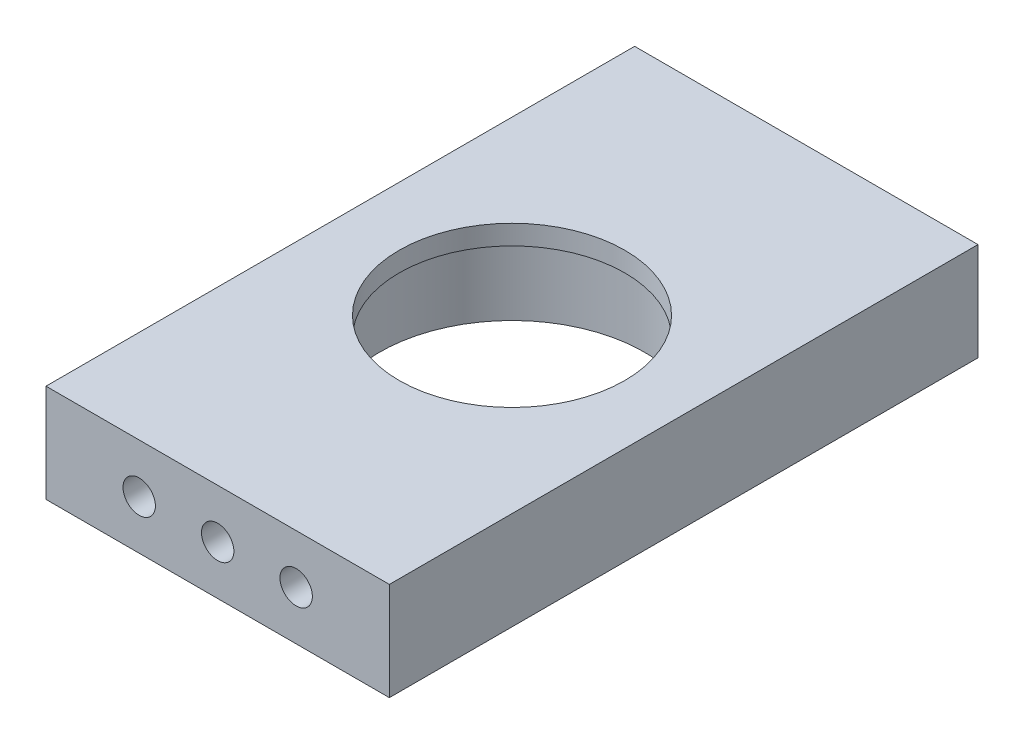
ISO-10303-21;
HEADER;
FILE_DESCRIPTION(('STEP AP214'),'2;1');
FILE_NAME('part.step','',(''),(''),'','','');
FILE_SCHEMA(('AUTOMOTIVE_DESIGN { 1 0 10303 214 1 1 1 1 }'));
ENDSEC;
DATA;
#1=APPLICATION_CONTEXT('core data for automotive mechanical design processes');
#2=APPLICATION_PROTOCOL_DEFINITION('international standard','automotive_design',2000,#1);
#3=PRODUCT_CONTEXT('',#1,'mechanical');
#4=PRODUCT('Part','Part','',(#3));
#5=PRODUCT_RELATED_PRODUCT_CATEGORY('part','',(#4));
#6=PRODUCT_DEFINITION_FORMATION('','',#4);
#7=PRODUCT_DEFINITION_CONTEXT('part definition',#1,'design');
#8=PRODUCT_DEFINITION('design','',#6,#7);
#9=PRODUCT_DEFINITION_SHAPE('','',#8);
#10=(LENGTH_UNIT() NAMED_UNIT(*) SI_UNIT(.MILLI.,.METRE.));
#11=(NAMED_UNIT(*) PLANE_ANGLE_UNIT() SI_UNIT($,.RADIAN.));
#12=(NAMED_UNIT(*) SI_UNIT($,.STERADIAN.) SOLID_ANGLE_UNIT());
#13=UNCERTAINTY_MEASURE_WITH_UNIT(LENGTH_MEASURE(1.E-05),#10,'distance_accuracy_value','');
#14=(GEOMETRIC_REPRESENTATION_CONTEXT(3) GLOBAL_UNCERTAINTY_ASSIGNED_CONTEXT((#13)) GLOBAL_UNIT_ASSIGNED_CONTEXT((#10,
#11,#12)) REPRESENTATION_CONTEXT('',''));
#15=CARTESIAN_POINT('',(0.,0.,0.));
#16=DIRECTION('',(0.,0.,1.));
#17=DIRECTION('',(1.,0.,0.));
#18=AXIS2_PLACEMENT_3D('',#15,#16,#17);
#19=CARTESIAN_POINT('',(0.,10.,0.));
#20=DIRECTION('',(0.,-1.,0.));
#21=DIRECTION('',(0.,0.,-1.));
#22=AXIS2_PLACEMENT_3D('',#19,#20,#21);
#23=CYLINDRICAL_SURFACE('',#22,13.5);
#24=CARTESIAN_POINT('',(0.,0.,0.));
#25=DIRECTION('',(0.,1.,0.));
#26=DIRECTION('',(0.,0.,1.));
#27=AXIS2_PLACEMENT_3D('',#24,#25,#26);
#28=CIRCLE('',#27,13.5);
#29=CARTESIAN_POINT('',(0.,0.,13.5));
#30=VERTEX_POINT('',#29);
#31=EDGE_CURVE('E158',#30,#30,#28,.T.);
#32=ORIENTED_EDGE('',*,*,#31,.F.);
#33=EDGE_LOOP('',(#32));
#34=FACE_BOUND('',#33,.T.);
#35=CARTESIAN_POINT('',(0.,8.,0.));
#36=DIRECTION('',(0.,1.,0.));
#37=DIRECTION('',(0.,0.,1.));
#38=AXIS2_PLACEMENT_3D('',#35,#36,#37);
#39=CIRCLE('',#38,13.5);
#40=CARTESIAN_POINT('',(0.,8.,13.5));
#41=VERTEX_POINT('',#40);
#42=EDGE_CURVE('E153',#41,#41,#39,.T.);
#43=ORIENTED_EDGE('',*,*,#42,.T.);
#44=EDGE_LOOP('',(#43));
#45=FACE_BOUND('',#44,.T.);
#46=ADVANCED_FACE('F37',(#34,#45),#23,.F.);
#47=CARTESIAN_POINT('',(0.,10.,0.));
#48=DIRECTION('',(0.,1.,0.));
#49=DIRECTION('',(0.,0.,1.));
#50=AXIS2_PLACEMENT_3D('',#47,#48,#49);
#51=PLANE('',#50);
#52=DIRECTION('',(0.,0.,-1.));
#53=VECTOR('',#52,1.);
#54=CARTESIAN_POINT('',(17.5,10.,-30.));
#55=LINE('',#54,#53);
#56=CARTESIAN_POINT('',(17.5,10.,30.));
#57=VERTEX_POINT('',#56);
#58=CARTESIAN_POINT('',(17.5,10.,-30.));
#59=VERTEX_POINT('',#58);
#60=EDGE_CURVE('E162',#57,#59,#55,.T.);
#61=ORIENTED_EDGE('',*,*,#60,.T.);
#62=DIRECTION('',(-1.,0.,0.));
#63=VECTOR('',#62,1.);
#64=CARTESIAN_POINT('',(-17.5,10.,-30.));
#65=LINE('',#64,#63);
#66=CARTESIAN_POINT('',(-17.5,10.,-30.));
#67=VERTEX_POINT('',#66);
#68=EDGE_CURVE('E85',#59,#67,#65,.T.);
#69=ORIENTED_EDGE('',*,*,#68,.T.);
#70=DIRECTION('',(0.,0.,1.));
#71=VECTOR('',#70,1.);
#72=CARTESIAN_POINT('',(-17.5,10.,-30.));
#73=LINE('',#72,#71);
#74=CARTESIAN_POINT('',(-17.5,10.,30.));
#75=VERTEX_POINT('',#74);
#76=EDGE_CURVE('E165',#67,#75,#73,.T.);
#77=ORIENTED_EDGE('',*,*,#76,.T.);
#78=DIRECTION('',(1.,0.,0.));
#79=VECTOR('',#78,1.);
#80=CARTESIAN_POINT('',(-17.5,10.,30.));
#81=LINE('',#80,#79);
#82=EDGE_CURVE('E54',#75,#57,#81,.T.);
#83=ORIENTED_EDGE('',*,*,#82,.T.);
#84=EDGE_LOOP('',(#61,#69,#77,#83));
#85=FACE_BOUND('',#84,.T.);
#86=CARTESIAN_POINT('',(0.,10.,0.));
#87=DIRECTION('',(0.,1.,0.));
#88=DIRECTION('',(0.,0.,1.));
#89=AXIS2_PLACEMENT_3D('',#86,#87,#88);
#90=CIRCLE('',#89,11.5);
#91=CARTESIAN_POINT('',(0.,10.,11.5));
#92=VERTEX_POINT('',#91);
#93=EDGE_CURVE('E149',#92,#92,#90,.T.);
#94=ORIENTED_EDGE('',*,*,#93,.F.);
#95=EDGE_LOOP('',(#94));
#96=FACE_BOUND('',#95,.T.);
#97=ADVANCED_FACE('F204',(#85,#96),#51,.T.);
#98=CARTESIAN_POINT('',(0.,0.,0.));
#99=DIRECTION('',(0.,1.,0.));
#100=DIRECTION('',(0.,0.,1.));
#101=AXIS2_PLACEMENT_3D('',#98,#99,#100);
#102=PLANE('',#101);
#103=DIRECTION('',(0.,0.,-1.));
#104=VECTOR('',#103,1.);
#105=CARTESIAN_POINT('',(17.5,0.,-30.));
#106=LINE('',#105,#104);
#107=CARTESIAN_POINT('',(17.5,0.,30.));
#108=VERTEX_POINT('',#107);
#109=CARTESIAN_POINT('',(17.5,0.,-30.));
#110=VERTEX_POINT('',#109);
#111=EDGE_CURVE('E161',#108,#110,#106,.T.);
#112=ORIENTED_EDGE('',*,*,#111,.F.);
#113=DIRECTION('',(1.,0.,0.));
#114=VECTOR('',#113,1.);
#115=CARTESIAN_POINT('',(-17.5,0.,30.));
#116=LINE('',#115,#114);
#117=CARTESIAN_POINT('',(-17.5,0.,30.));
#118=VERTEX_POINT('',#117);
#119=EDGE_CURVE('E78',#118,#108,#116,.T.);
#120=ORIENTED_EDGE('',*,*,#119,.F.);
#121=DIRECTION('',(0.,0.,1.));
#122=VECTOR('',#121,1.);
#123=CARTESIAN_POINT('',(-17.5,0.,-30.));
#124=LINE('',#123,#122);
#125=CARTESIAN_POINT('',(-17.5,0.,-30.));
#126=VERTEX_POINT('',#125);
#127=EDGE_CURVE('E72',#126,#118,#124,.T.);
#128=ORIENTED_EDGE('',*,*,#127,.F.);
#129=DIRECTION('',(-1.,0.,0.));
#130=VECTOR('',#129,1.);
#131=CARTESIAN_POINT('',(-17.5,0.,-30.));
#132=LINE('',#131,#130);
#133=EDGE_CURVE('E171',#110,#126,#132,.T.);
#134=ORIENTED_EDGE('',*,*,#133,.F.);
#135=EDGE_LOOP('',(#112,#120,#128,#134));
#136=FACE_BOUND('',#135,.T.);
#137=ORIENTED_EDGE('',*,*,#31,.T.);
#138=EDGE_LOOP('',(#137));
#139=FACE_BOUND('',#138,.T.);
#140=ADVANCED_FACE('F181',(#136,#139),#102,.F.);
#141=CARTESIAN_POINT('',(17.5,10.,-30.));
#142=DIRECTION('',(-1.,0.,0.));
#143=DIRECTION('',(0.,0.,1.));
#144=AXIS2_PLACEMENT_3D('',#141,#142,#143);
#145=PLANE('',#144);
#146=ORIENTED_EDGE('',*,*,#111,.T.);
#147=DIRECTION('',(0.,-1.,0.));
#148=VECTOR('',#147,1.);
#149=CARTESIAN_POINT('',(17.5,10.,-30.));
#150=LINE('',#149,#148);
#151=EDGE_CURVE('E11',#59,#110,#150,.T.);
#152=ORIENTED_EDGE('',*,*,#151,.F.);
#153=ORIENTED_EDGE('',*,*,#60,.F.);
#154=DIRECTION('',(0.,-1.,0.));
#155=VECTOR('',#154,1.);
#156=CARTESIAN_POINT('',(17.5,10.,30.));
#157=LINE('',#156,#155);
#158=EDGE_CURVE('E168',#57,#108,#157,.T.);
#159=ORIENTED_EDGE('',*,*,#158,.T.);
#160=EDGE_LOOP('',(#146,#152,#153,#159));
#161=FACE_BOUND('',#160,.T.);
#162=ADVANCED_FACE('F39',(#161),#145,.F.);
#163=CARTESIAN_POINT('',(-17.5,10.,-30.));
#164=DIRECTION('',(0.,0.,1.));
#165=DIRECTION('',(1.,0.,0.));
#166=AXIS2_PLACEMENT_3D('',#163,#164,#165);
#167=PLANE('',#166);
#168=CARTESIAN_POINT('',(8.,5.,-30.));
#169=DIRECTION('',(0.,0.,-1.));
#170=DIRECTION('',(-1.,0.,0.));
#171=AXIS2_PLACEMENT_3D('',#168,#169,#170);
#172=CIRCLE('',#171,1.64999999999999);
#173=CARTESIAN_POINT('',(6.35000000000001,5.,-30.));
#174=VERTEX_POINT('',#173);
#175=EDGE_CURVE('E115',#174,#174,#172,.T.);
#176=ORIENTED_EDGE('',*,*,#175,.F.);
#177=EDGE_LOOP('',(#176));
#178=FACE_BOUND('',#177,.T.);
#179=CARTESIAN_POINT('',(0.,5.,-30.));
#180=DIRECTION('',(0.,0.,-1.));
#181=DIRECTION('',(-1.,0.,0.));
#182=AXIS2_PLACEMENT_3D('',#179,#180,#181);
#183=CIRCLE('',#182,1.64999999999999);
#184=CARTESIAN_POINT('',(-1.64999999999999,5.,-30.));
#185=VERTEX_POINT('',#184);
#186=EDGE_CURVE('E114',#185,#185,#183,.T.);
#187=ORIENTED_EDGE('',*,*,#186,.F.);
#188=EDGE_LOOP('',(#187));
#189=FACE_BOUND('',#188,.T.);
#190=CARTESIAN_POINT('',(-8.,5.,-30.));
#191=DIRECTION('',(0.,0.,-1.));
#192=DIRECTION('',(-1.,0.,0.));
#193=AXIS2_PLACEMENT_3D('',#190,#191,#192);
#194=CIRCLE('',#193,1.64999999999999);
#195=CARTESIAN_POINT('',(-9.64999999999999,5.,-30.));
#196=VERTEX_POINT('',#195);
#197=EDGE_CURVE('E125',#196,#196,#194,.T.);
#198=ORIENTED_EDGE('',*,*,#197,.F.);
#199=EDGE_LOOP('',(#198));
#200=FACE_BOUND('',#199,.T.);
#201=ORIENTED_EDGE('',*,*,#133,.T.);
#202=DIRECTION('',(0.,-1.,0.));
#203=VECTOR('',#202,1.);
#204=CARTESIAN_POINT('',(-17.5,10.,-30.));
#205=LINE('',#204,#203);
#206=EDGE_CURVE('E46',#67,#126,#205,.T.);
#207=ORIENTED_EDGE('',*,*,#206,.F.);
#208=ORIENTED_EDGE('',*,*,#68,.F.);
#209=ORIENTED_EDGE('',*,*,#151,.T.);
#210=EDGE_LOOP('',(#201,#207,#208,#209));
#211=FACE_BOUND('',#210,.T.);
#212=ADVANCED_FACE('F198',(#178,#189,#200,#211),#167,.F.);
#213=CARTESIAN_POINT('',(-17.5,10.,-30.));
#214=DIRECTION('',(1.,0.,0.));
#215=DIRECTION('',(0.,0.,-1.));
#216=AXIS2_PLACEMENT_3D('',#213,#214,#215);
#217=PLANE('',#216);
#218=ORIENTED_EDGE('',*,*,#127,.T.);
#219=DIRECTION('',(0.,-1.,0.));
#220=VECTOR('',#219,1.);
#221=CARTESIAN_POINT('',(-17.5,10.,30.));
#222=LINE('',#221,#220);
#223=EDGE_CURVE('E176',#75,#118,#222,.T.);
#224=ORIENTED_EDGE('',*,*,#223,.F.);
#225=ORIENTED_EDGE('',*,*,#76,.F.);
#226=ORIENTED_EDGE('',*,*,#206,.T.);
#227=EDGE_LOOP('',(#218,#224,#225,#226));
#228=FACE_BOUND('',#227,.T.);
#229=ADVANCED_FACE('F178',(#228),#217,.F.);
#230=CARTESIAN_POINT('',(-17.5,10.,30.));
#231=DIRECTION('',(0.,0.,-1.));
#232=DIRECTION('',(-1.,0.,0.));
#233=AXIS2_PLACEMENT_3D('',#230,#231,#232);
#234=PLANE('',#233);
#235=CARTESIAN_POINT('',(-8.,5.,30.));
#236=DIRECTION('',(0.,0.,1.));
#237=DIRECTION('',(1.,0.,0.));
#238=AXIS2_PLACEMENT_3D('',#235,#236,#237);
#239=CIRCLE('',#238,1.64999999999999);
#240=CARTESIAN_POINT('',(-6.35000000000001,5.,30.));
#241=VERTEX_POINT('',#240);
#242=EDGE_CURVE('E131',#241,#241,#239,.T.);
#243=ORIENTED_EDGE('',*,*,#242,.F.);
#244=EDGE_LOOP('',(#243));
#245=FACE_BOUND('',#244,.T.);
#246=CARTESIAN_POINT('',(0.,5.,30.));
#247=DIRECTION('',(0.,0.,1.));
#248=DIRECTION('',(1.,0.,0.));
#249=AXIS2_PLACEMENT_3D('',#246,#247,#248);
#250=CIRCLE('',#249,1.64999999999999);
#251=CARTESIAN_POINT('',(1.64999999999999,5.,30.));
#252=VERTEX_POINT('',#251);
#253=EDGE_CURVE('E137',#252,#252,#250,.T.);
#254=ORIENTED_EDGE('',*,*,#253,.F.);
#255=EDGE_LOOP('',(#254));
#256=FACE_BOUND('',#255,.T.);
#257=CARTESIAN_POINT('',(8.,5.,30.));
#258=DIRECTION('',(0.,0.,1.));
#259=DIRECTION('',(1.,0.,0.));
#260=AXIS2_PLACEMENT_3D('',#257,#258,#259);
#261=CIRCLE('',#260,1.64999999999999);
#262=CARTESIAN_POINT('',(9.64999999999999,5.,30.));
#263=VERTEX_POINT('',#262);
#264=EDGE_CURVE('E143',#263,#263,#261,.T.);
#265=ORIENTED_EDGE('',*,*,#264,.F.);
#266=EDGE_LOOP('',(#265));
#267=FACE_BOUND('',#266,.T.);
#268=ORIENTED_EDGE('',*,*,#119,.T.);
#269=ORIENTED_EDGE('',*,*,#158,.F.);
#270=ORIENTED_EDGE('',*,*,#82,.F.);
#271=ORIENTED_EDGE('',*,*,#223,.T.);
#272=EDGE_LOOP('',(#268,#269,#270,#271));
#273=FACE_BOUND('',#272,.T.);
#274=ADVANCED_FACE('F186',(#245,#256,#267,#273),#234,.F.);
#275=CARTESIAN_POINT('',(0.,8.,0.));
#276=DIRECTION('',(0.,1.,0.));
#277=DIRECTION('',(0.,0.,1.));
#278=AXIS2_PLACEMENT_3D('',#275,#276,#277);
#279=PLANE('',#278);
#280=CARTESIAN_POINT('',(0.,8.,0.));
#281=DIRECTION('',(0.,1.,0.));
#282=DIRECTION('',(0.,0.,1.));
#283=AXIS2_PLACEMENT_3D('',#280,#281,#282);
#284=CIRCLE('',#283,11.5);
#285=CARTESIAN_POINT('',(0.,8.,11.5));
#286=VERTEX_POINT('',#285);
#287=EDGE_CURVE('E150',#286,#286,#284,.T.);
#288=ORIENTED_EDGE('',*,*,#287,.T.);
#289=EDGE_LOOP('',(#288));
#290=FACE_BOUND('',#289,.T.);
#291=ORIENTED_EDGE('',*,*,#42,.F.);
#292=EDGE_LOOP('',(#291));
#293=FACE_BOUND('',#292,.T.);
#294=ADVANCED_FACE('F188',(#290,#293),#279,.F.);
#295=CARTESIAN_POINT('',(0.,8.,0.));
#296=DIRECTION('',(0.,1.,0.));
#297=DIRECTION('',(0.,0.,1.));
#298=AXIS2_PLACEMENT_3D('',#295,#296,#297);
#299=CYLINDRICAL_SURFACE('',#298,11.5);
#300=ORIENTED_EDGE('',*,*,#287,.F.);
#301=EDGE_LOOP('',(#300));
#302=FACE_BOUND('',#301,.T.);
#303=ORIENTED_EDGE('',*,*,#93,.T.);
#304=EDGE_LOOP('',(#303));
#305=FACE_BOUND('',#304,.T.);
#306=ADVANCED_FACE('F195',(#302,#305),#299,.F.);
#307=CARTESIAN_POINT('',(8.,5.,18.5));
#308=DIRECTION('',(0.,0.,1.));
#309=DIRECTION('',(1.,0.,0.));
#310=AXIS2_PLACEMENT_3D('',#307,#308,#309);
#311=CONICAL_SURFACE('',#310,1.65,1.02974425867665);
#312=CARTESIAN_POINT('',(8.,5.,17.5085799786045));
#313=VERTEX_POINT('',#312);
#314=VERTEX_LOOP('',#313);
#315=FACE_BOUND('',#314,.T.);
#316=CARTESIAN_POINT('',(8.,5.,18.5));
#317=DIRECTION('',(0.,0.,1.));
#318=DIRECTION('',(1.,0.,0.));
#319=AXIS2_PLACEMENT_3D('',#316,#317,#318);
#320=CIRCLE('',#319,1.65);
#321=CARTESIAN_POINT('',(9.65,5.,18.5));
#322=VERTEX_POINT('',#321);
#323=EDGE_CURVE('E146',#322,#322,#320,.T.);
#324=ORIENTED_EDGE('',*,*,#323,.T.);
#325=EDGE_LOOP('',(#324));
#326=FACE_BOUND('',#325,.T.);
#327=ADVANCED_FACE('F266',(#315,#326),#311,.F.);
#328=CARTESIAN_POINT('',(8.,5.,30.));
#329=DIRECTION('',(0.,0.,1.));
#330=DIRECTION('',(1.,0.,0.));
#331=AXIS2_PLACEMENT_3D('',#328,#329,#330);
#332=CYLINDRICAL_SURFACE('',#331,1.64999999999999);
#333=ORIENTED_EDGE('',*,*,#323,.F.);
#334=EDGE_LOOP('',(#333));
#335=FACE_BOUND('',#334,.T.);
#336=ORIENTED_EDGE('',*,*,#264,.T.);
#337=EDGE_LOOP('',(#336));
#338=FACE_BOUND('',#337,.T.);
#339=ADVANCED_FACE('F262',(#335,#338),#332,.F.);
#340=CARTESIAN_POINT('',(0.,5.,18.5));
#341=DIRECTION('',(0.,0.,1.));
#342=DIRECTION('',(1.,0.,0.));
#343=AXIS2_PLACEMENT_3D('',#340,#341,#342);
#344=CONICAL_SURFACE('',#343,1.65,1.02974425867665);
#345=CARTESIAN_POINT('',(0.,5.,17.5085799786045));
#346=VERTEX_POINT('',#345);
#347=VERTEX_LOOP('',#346);
#348=FACE_BOUND('',#347,.T.);
#349=CARTESIAN_POINT('',(0.,5.,18.5));
#350=DIRECTION('',(0.,0.,1.));
#351=DIRECTION('',(1.,0.,0.));
#352=AXIS2_PLACEMENT_3D('',#349,#350,#351);
#353=CIRCLE('',#352,1.65);
#354=CARTESIAN_POINT('',(1.65,5.,18.5));
#355=VERTEX_POINT('',#354);
#356=EDGE_CURVE('E140',#355,#355,#353,.T.);
#357=ORIENTED_EDGE('',*,*,#356,.T.);
#358=EDGE_LOOP('',(#357));
#359=FACE_BOUND('',#358,.T.);
#360=ADVANCED_FACE('F258',(#348,#359),#344,.F.);
#361=CARTESIAN_POINT('',(0.,5.,30.));
#362=DIRECTION('',(0.,0.,1.));
#363=DIRECTION('',(1.,0.,0.));
#364=AXIS2_PLACEMENT_3D('',#361,#362,#363);
#365=CYLINDRICAL_SURFACE('',#364,1.64999999999999);
#366=ORIENTED_EDGE('',*,*,#356,.F.);
#367=EDGE_LOOP('',(#366));
#368=FACE_BOUND('',#367,.T.);
#369=ORIENTED_EDGE('',*,*,#253,.T.);
#370=EDGE_LOOP('',(#369));
#371=FACE_BOUND('',#370,.T.);
#372=ADVANCED_FACE('F254',(#368,#371),#365,.F.);
#373=CARTESIAN_POINT('',(-8.,5.,18.5));
#374=DIRECTION('',(0.,0.,1.));
#375=DIRECTION('',(1.,0.,0.));
#376=AXIS2_PLACEMENT_3D('',#373,#374,#375);
#377=CONICAL_SURFACE('',#376,1.65,1.02974425867665);
#378=CARTESIAN_POINT('',(-8.,5.,17.5085799786045));
#379=VERTEX_POINT('',#378);
#380=VERTEX_LOOP('',#379);
#381=FACE_BOUND('',#380,.T.);
#382=CARTESIAN_POINT('',(-8.,5.,18.5));
#383=DIRECTION('',(0.,0.,1.));
#384=DIRECTION('',(1.,0.,0.));
#385=AXIS2_PLACEMENT_3D('',#382,#383,#384);
#386=CIRCLE('',#385,1.65);
#387=CARTESIAN_POINT('',(-6.35,5.,18.5));
#388=VERTEX_POINT('',#387);
#389=EDGE_CURVE('E134',#388,#388,#386,.T.);
#390=ORIENTED_EDGE('',*,*,#389,.T.);
#391=EDGE_LOOP('',(#390));
#392=FACE_BOUND('',#391,.T.);
#393=ADVANCED_FACE('F250',(#381,#392),#377,.F.);
#394=CARTESIAN_POINT('',(-8.,5.,30.));
#395=DIRECTION('',(0.,0.,1.));
#396=DIRECTION('',(1.,0.,0.));
#397=AXIS2_PLACEMENT_3D('',#394,#395,#396);
#398=CYLINDRICAL_SURFACE('',#397,1.64999999999999);
#399=ORIENTED_EDGE('',*,*,#389,.F.);
#400=EDGE_LOOP('',(#399));
#401=FACE_BOUND('',#400,.T.);
#402=ORIENTED_EDGE('',*,*,#242,.T.);
#403=EDGE_LOOP('',(#402));
#404=FACE_BOUND('',#403,.T.);
#405=ADVANCED_FACE('F242',(#401,#404),#398,.F.);
#406=CARTESIAN_POINT('',(-8.,5.,-18.5));
#407=DIRECTION('',(0.,0.,-1.));
#408=DIRECTION('',(-1.,0.,0.));
#409=AXIS2_PLACEMENT_3D('',#406,#407,#408);
#410=CONICAL_SURFACE('',#409,1.64999999999999,1.02974425867665);
#411=CARTESIAN_POINT('',(-8.,5.,-17.5085799786045));
#412=VERTEX_POINT('',#411);
#413=VERTEX_LOOP('',#412);
#414=FACE_BOUND('',#413,.T.);
#415=CARTESIAN_POINT('',(-8.,5.,-18.5));
#416=DIRECTION('',(0.,0.,-1.));
#417=DIRECTION('',(-1.,0.,0.));
#418=AXIS2_PLACEMENT_3D('',#415,#416,#417);
#419=CIRCLE('',#418,1.64999999999999);
#420=CARTESIAN_POINT('',(-9.64999999999999,5.,-18.5));
#421=VERTEX_POINT('',#420);
#422=EDGE_CURVE('E128',#421,#421,#419,.T.);
#423=ORIENTED_EDGE('',*,*,#422,.T.);
#424=EDGE_LOOP('',(#423));
#425=FACE_BOUND('',#424,.T.);
#426=ADVANCED_FACE('F233',(#414,#425),#410,.F.);
#427=CARTESIAN_POINT('',(-8.,5.,-30.));
#428=DIRECTION('',(0.,0.,-1.));
#429=DIRECTION('',(-1.,0.,0.));
#430=AXIS2_PLACEMENT_3D('',#427,#428,#429);
#431=CYLINDRICAL_SURFACE('',#430,1.64999999999999);
#432=ORIENTED_EDGE('',*,*,#422,.F.);
#433=EDGE_LOOP('',(#432));
#434=FACE_BOUND('',#433,.T.);
#435=ORIENTED_EDGE('',*,*,#197,.T.);
#436=EDGE_LOOP('',(#435));
#437=FACE_BOUND('',#436,.T.);
#438=ADVANCED_FACE('F230',(#434,#437),#431,.F.);
#439=CARTESIAN_POINT('',(0.,5.,-18.5));
#440=DIRECTION('',(0.,0.,-1.));
#441=DIRECTION('',(-1.,0.,0.));
#442=AXIS2_PLACEMENT_3D('',#439,#440,#441);
#443=CONICAL_SURFACE('',#442,1.64999999999999,1.02974425867665);
#444=CARTESIAN_POINT('',(0.,5.,-17.5085799786045));
#445=VERTEX_POINT('',#444);
#446=VERTEX_LOOP('',#445);
#447=FACE_BOUND('',#446,.T.);
#448=CARTESIAN_POINT('',(0.,5.,-18.5));
#449=DIRECTION('',(0.,0.,-1.));
#450=DIRECTION('',(-1.,0.,0.));
#451=AXIS2_PLACEMENT_3D('',#448,#449,#450);
#452=CIRCLE('',#451,1.64999999999999);
#453=CARTESIAN_POINT('',(-1.64999999999999,5.,-18.5));
#454=VERTEX_POINT('',#453);
#455=EDGE_CURVE('E118',#454,#454,#452,.T.);
#456=ORIENTED_EDGE('',*,*,#455,.T.);
#457=EDGE_LOOP('',(#456));
#458=FACE_BOUND('',#457,.T.);
#459=ADVANCED_FACE('F232',(#447,#458),#443,.F.);
#460=CARTESIAN_POINT('',(0.,5.,-30.));
#461=DIRECTION('',(0.,0.,-1.));
#462=DIRECTION('',(-1.,0.,0.));
#463=AXIS2_PLACEMENT_3D('',#460,#461,#462);
#464=CYLINDRICAL_SURFACE('',#463,1.64999999999999);
#465=ORIENTED_EDGE('',*,*,#455,.F.);
#466=EDGE_LOOP('',(#465));
#467=FACE_BOUND('',#466,.T.);
#468=ORIENTED_EDGE('',*,*,#186,.T.);
#469=EDGE_LOOP('',(#468));
#470=FACE_BOUND('',#469,.T.);
#471=ADVANCED_FACE('F108',(#467,#470),#464,.F.);
#472=CARTESIAN_POINT('',(8.,5.,-18.5));
#473=DIRECTION('',(0.,0.,-1.));
#474=DIRECTION('',(-1.,0.,0.));
#475=AXIS2_PLACEMENT_3D('',#472,#473,#474);
#476=CONICAL_SURFACE('',#475,1.64999999999999,1.02974425867665);
#477=CARTESIAN_POINT('',(8.,5.,-17.5085799786045));
#478=VERTEX_POINT('',#477);
#479=VERTEX_LOOP('',#478);
#480=FACE_BOUND('',#479,.T.);
#481=CARTESIAN_POINT('',(8.,5.,-18.5));
#482=DIRECTION('',(0.,0.,-1.));
#483=DIRECTION('',(-1.,0.,0.));
#484=AXIS2_PLACEMENT_3D('',#481,#482,#483);
#485=CIRCLE('',#484,1.64999999999999);
#486=CARTESIAN_POINT('',(6.35000000000001,5.,-18.5));
#487=VERTEX_POINT('',#486);
#488=EDGE_CURVE('E112',#487,#487,#485,.T.);
#489=ORIENTED_EDGE('',*,*,#488,.T.);
#490=EDGE_LOOP('',(#489));
#491=FACE_BOUND('',#490,.T.);
#492=ADVANCED_FACE('F104',(#480,#491),#476,.F.);
#493=CARTESIAN_POINT('',(8.,5.,-30.));
#494=DIRECTION('',(0.,0.,-1.));
#495=DIRECTION('',(-1.,0.,0.));
#496=AXIS2_PLACEMENT_3D('',#493,#494,#495);
#497=CYLINDRICAL_SURFACE('',#496,1.64999999999999);
#498=ORIENTED_EDGE('',*,*,#488,.F.);
#499=EDGE_LOOP('',(#498));
#500=FACE_BOUND('',#499,.T.);
#501=ORIENTED_EDGE('',*,*,#175,.T.);
#502=EDGE_LOOP('',(#501));
#503=FACE_BOUND('',#502,.T.);
#504=ADVANCED_FACE('F107',(#500,#503),#497,.F.);
#505=CLOSED_SHELL('',(#46,#97,#140,#162,#212,#229,#274,#294,#306,#327,#339,#360,#372,#393,#405,
#426,#438,#459,#471,#492,#504));
#506=MANIFOLD_SOLID_BREP('B2',#505);
#507=ADVANCED_BREP_SHAPE_REPRESENTATION('',(#18,#506),#14);
#508=SHAPE_DEFINITION_REPRESENTATION(#9,#507);
ENDSEC;
END-ISO-10303-21;
